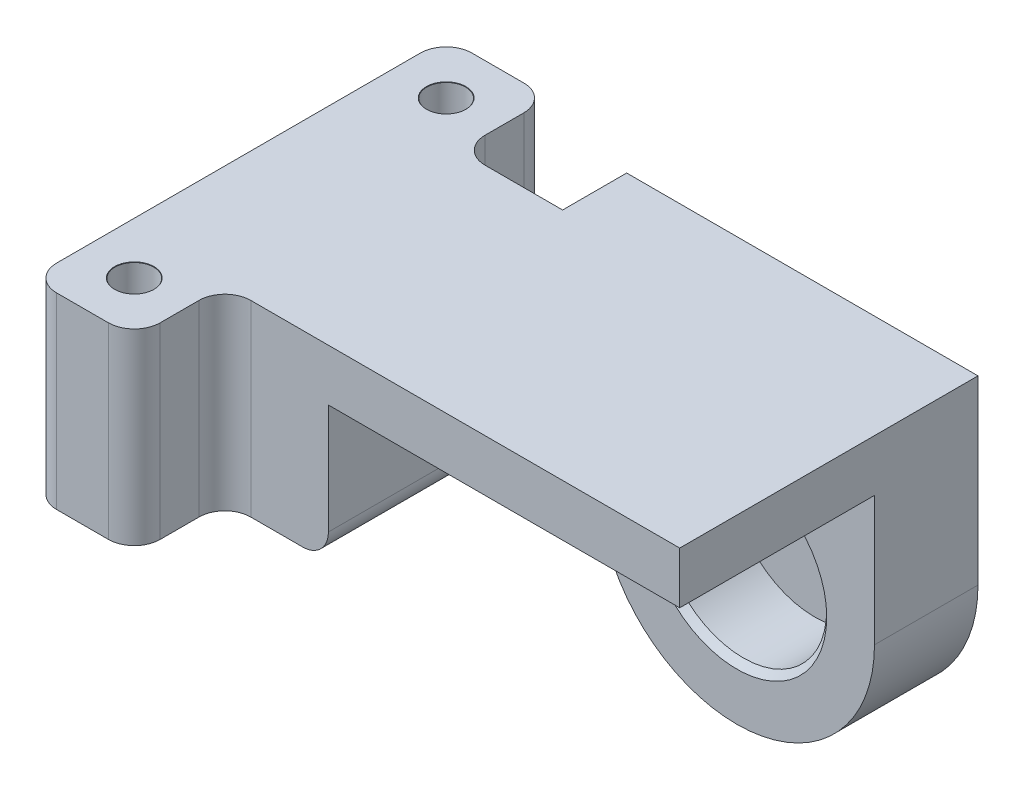
ISO-10303-21;
HEADER;
FILE_DESCRIPTION(('STEP AP214'),'2;1');
FILE_NAME('part.step','',(''),(''),'','','');
FILE_SCHEMA(('AUTOMOTIVE_DESIGN { 1 0 10303 214 1 1 1 1 }'));
ENDSEC;
DATA;
#1=APPLICATION_CONTEXT('core data for automotive mechanical design processes');
#2=APPLICATION_PROTOCOL_DEFINITION('international standard','automotive_design',2000,#1);
#3=PRODUCT_CONTEXT('',#1,'mechanical');
#4=PRODUCT('Part','Part','',(#3));
#5=PRODUCT_RELATED_PRODUCT_CATEGORY('part','',(#4));
#6=PRODUCT_DEFINITION_FORMATION('','',#4);
#7=PRODUCT_DEFINITION_CONTEXT('part definition',#1,'design');
#8=PRODUCT_DEFINITION('design','',#6,#7);
#9=PRODUCT_DEFINITION_SHAPE('','',#8);
#10=(LENGTH_UNIT() NAMED_UNIT(*) SI_UNIT(.MILLI.,.METRE.));
#11=(NAMED_UNIT(*) PLANE_ANGLE_UNIT() SI_UNIT($,.RADIAN.));
#12=(NAMED_UNIT(*) SI_UNIT($,.STERADIAN.) SOLID_ANGLE_UNIT());
#13=UNCERTAINTY_MEASURE_WITH_UNIT(LENGTH_MEASURE(1.E-05),#10,'distance_accuracy_value','');
#14=(GEOMETRIC_REPRESENTATION_CONTEXT(3) GLOBAL_UNCERTAINTY_ASSIGNED_CONTEXT((#13)) GLOBAL_UNIT_ASSIGNED_CONTEXT((#10,
#11,#12)) REPRESENTATION_CONTEXT('',''));
#15=CARTESIAN_POINT('',(0.,0.,0.));
#16=DIRECTION('',(0.,0.,1.));
#17=DIRECTION('',(1.,0.,0.));
#18=AXIS2_PLACEMENT_3D('',#15,#16,#17);
#19=CARTESIAN_POINT('',(43.15,4.,-9.05));
#20=DIRECTION('',(0.,0.,1.));
#21=DIRECTION('',(1.,0.,0.));
#22=AXIS2_PLACEMENT_3D('',#19,#20,#21);
#23=PLANE('',#22);
#24=DIRECTION('',(0.,1.,0.));
#25=VECTOR('',#24,1.);
#26=CARTESIAN_POINT('',(16.,4.,-9.05));
#27=LINE('',#26,#25);
#28=CARTESIAN_POINT('',(16.,0.,-9.05));
#29=VERTEX_POINT('',#28);
#30=CARTESIAN_POINT('',(16.,4.,-9.05));
#31=VERTEX_POINT('',#30);
#32=EDGE_CURVE('E238',#29,#31,#27,.T.);
#33=ORIENTED_EDGE('',*,*,#32,.F.);
#34=DIRECTION('',(0.,1.,0.));
#35=VECTOR('',#34,1.);
#36=CARTESIAN_POINT('',(16.,-10.5,-9.05));
#37=LINE('',#36,#35);
#38=CARTESIAN_POINT('',(16.,-8.5,-9.05));
#39=VERTEX_POINT('',#38);
#40=EDGE_CURVE('E327',#39,#29,#37,.T.);
#41=ORIENTED_EDGE('',*,*,#40,.F.);
#42=CARTESIAN_POINT('',(14.,-8.5,-9.05));
#43=DIRECTION('',(0.,0.,1.));
#44=DIRECTION('',(1.,0.,0.));
#45=AXIS2_PLACEMENT_3D('',#42,#43,#44);
#46=CIRCLE('',#45,2.);
#47=CARTESIAN_POINT('',(14.,-10.5,-9.05));
#48=VERTEX_POINT('',#47);
#49=EDGE_CURVE('E450',#39,#48,#46,.F.);
#50=ORIENTED_EDGE('',*,*,#49,.T.);
#51=DIRECTION('',(1.,0.,0.));
#52=VECTOR('',#51,1.);
#53=CARTESIAN_POINT('',(10.,-10.5,-9.05));
#54=LINE('',#53,#52);
#55=CARTESIAN_POINT('',(10.,-10.5,-9.05));
#56=VERTEX_POINT('',#55);
#57=EDGE_CURVE('E298',#56,#48,#54,.T.);
#58=ORIENTED_EDGE('',*,*,#57,.F.);
#59=DIRECTION('',(0.,-1.,0.));
#60=VECTOR('',#59,1.);
#61=CARTESIAN_POINT('',(10.,4.,-9.05));
#62=LINE('',#61,#60);
#63=CARTESIAN_POINT('',(10.,4.,-9.05));
#64=VERTEX_POINT('',#63);
#65=EDGE_CURVE('E414',#56,#64,#62,.F.);
#66=ORIENTED_EDGE('',*,*,#65,.T.);
#67=DIRECTION('',(-1.,0.,0.));
#68=VECTOR('',#67,1.);
#69=CARTESIAN_POINT('',(43.15,4.,-9.05));
#70=LINE('',#69,#68);
#71=EDGE_CURVE('E370',#31,#64,#70,.T.);
#72=ORIENTED_EDGE('',*,*,#71,.F.);
#73=EDGE_LOOP('',(#33,#41,#50,#58,#66,#72));
#74=FACE_BOUND('',#73,.T.);
#75=ADVANCED_FACE('F45',(#74),#23,.F.);
#76=CARTESIAN_POINT('',(0.,0.,0.));
#77=DIRECTION('',(0.,1.,0.));
#78=DIRECTION('',(0.,0.,1.));
#79=AXIS2_PLACEMENT_3D('',#76,#77,#78);
#80=PLANE('',#79);
#81=DIRECTION('',(-1.,0.,0.));
#82=VECTOR('',#81,1.);
#83=CARTESIAN_POINT('',(43.15,0.,-14.));
#84=LINE('',#83,#82);
#85=CARTESIAN_POINT('',(21.87,0.,-14.));
#86=VERTEX_POINT('',#85);
#87=CARTESIAN_POINT('',(16.,0.,-14.));
#88=VERTEX_POINT('',#87);
#89=EDGE_CURVE('E244',#86,#88,#84,.T.);
#90=ORIENTED_EDGE('',*,*,#89,.F.);
#91=DIRECTION('',(0.,0.,-1.));
#92=VECTOR('',#91,1.);
#93=CARTESIAN_POINT('',(21.87,0.,-6.));
#94=LINE('',#93,#92);
#95=CARTESIAN_POINT('',(21.87,0.,-6.));
#96=VERTEX_POINT('',#95);
#97=EDGE_CURVE('E235',#96,#86,#94,.T.);
#98=ORIENTED_EDGE('',*,*,#97,.F.);
#99=DIRECTION('',(1.,0.,0.));
#100=VECTOR('',#99,1.);
#101=CARTESIAN_POINT('',(43.15,0.,-6.));
#102=LINE('',#101,#100);
#103=CARTESIAN_POINT('',(43.15,0.,-6.));
#104=VERTEX_POINT('',#103);
#105=EDGE_CURVE('E206',#96,#104,#102,.T.);
#106=ORIENTED_EDGE('',*,*,#105,.T.);
#107=DIRECTION('',(0.,0.,-1.));
#108=VECTOR('',#107,1.);
#109=CARTESIAN_POINT('',(43.15,0.,9.05));
#110=LINE('',#109,#108);
#111=CARTESIAN_POINT('',(43.15,0.,9.05));
#112=VERTEX_POINT('',#111);
#113=EDGE_CURVE('E221',#112,#104,#110,.T.);
#114=ORIENTED_EDGE('',*,*,#113,.F.);
#115=DIRECTION('',(1.,0.,0.));
#116=VECTOR('',#115,1.);
#117=CARTESIAN_POINT('',(8.,0.,9.05));
#118=LINE('',#117,#116);
#119=CARTESIAN_POINT('',(16.,0.,9.05));
#120=VERTEX_POINT('',#119);
#121=EDGE_CURVE('E347',#120,#112,#118,.T.);
#122=ORIENTED_EDGE('',*,*,#121,.F.);
#123=DIRECTION('',(0.,0.,1.));
#124=VECTOR('',#123,1.);
#125=CARTESIAN_POINT('',(16.,0.,9.05));
#126=LINE('',#125,#124);
#127=EDGE_CURVE('E269',#29,#120,#126,.T.);
#128=ORIENTED_EDGE('',*,*,#127,.F.);
#129=DIRECTION('',(0.,0.,1.));
#130=VECTOR('',#129,1.);
#131=CARTESIAN_POINT('',(16.,0.,-14.));
#132=LINE('',#131,#130);
#133=EDGE_CURVE('E258',#88,#29,#132,.T.);
#134=ORIENTED_EDGE('',*,*,#133,.F.);
#135=EDGE_LOOP('',(#90,#98,#106,#114,#122,#128,#134));
#136=FACE_BOUND('',#135,.T.);
#137=ADVANCED_FACE('F469',(#136),#80,.F.);
#138=CARTESIAN_POINT('',(8.,4.,-16.05));
#139=DIRECTION('',(0.,0.,1.));
#140=DIRECTION('',(1.,0.,0.));
#141=AXIS2_PLACEMENT_3D('',#138,#139,#140);
#142=PLANE('',#141);
#143=DIRECTION('',(0.,-1.,0.));
#144=VECTOR('',#143,1.);
#145=CARTESIAN_POINT('',(6.,4.,-16.05));
#146=LINE('',#145,#144);
#147=CARTESIAN_POINT('',(6.,4.,-16.05));
#148=VERTEX_POINT('',#147);
#149=CARTESIAN_POINT('',(6.,-10.5,-16.05));
#150=VERTEX_POINT('',#149);
#151=EDGE_CURVE('E390',#148,#150,#146,.T.);
#152=ORIENTED_EDGE('',*,*,#151,.T.);
#153=DIRECTION('',(1.,0.,0.));
#154=VECTOR('',#153,1.);
#155=CARTESIAN_POINT('',(2.,-10.5,-16.05));
#156=LINE('',#155,#154);
#157=CARTESIAN_POINT('',(2.,-10.5,-16.05));
#158=VERTEX_POINT('',#157);
#159=EDGE_CURVE('E282',#158,#150,#156,.T.);
#160=ORIENTED_EDGE('',*,*,#159,.F.);
#161=DIRECTION('',(0.,-1.,0.));
#162=VECTOR('',#161,1.);
#163=CARTESIAN_POINT('',(2.,4.,-16.05));
#164=LINE('',#163,#162);
#165=CARTESIAN_POINT('',(2.,4.,-16.05));
#166=VERTEX_POINT('',#165);
#167=EDGE_CURVE('E393',#158,#166,#164,.F.);
#168=ORIENTED_EDGE('',*,*,#167,.T.);
#169=DIRECTION('',(-1.,0.,0.));
#170=VECTOR('',#169,1.);
#171=CARTESIAN_POINT('',(8.,4.,-16.05));
#172=LINE('',#171,#170);
#173=EDGE_CURVE('E348',#148,#166,#172,.T.);
#174=ORIENTED_EDGE('',*,*,#173,.F.);
#175=EDGE_LOOP('',(#152,#160,#168,#174));
#176=FACE_BOUND('',#175,.T.);
#177=ADVANCED_FACE('F475',(#176),#142,.F.);
#178=CARTESIAN_POINT('',(0.,4.,-16.05));
#179=DIRECTION('',(1.,0.,0.));
#180=DIRECTION('',(0.,0.,-1.));
#181=AXIS2_PLACEMENT_3D('',#178,#179,#180);
#182=PLANE('',#181);
#183=DIRECTION('',(0.,0.,1.));
#184=VECTOR('',#183,1.);
#185=CARTESIAN_POINT('',(0.,4.,-16.05));
#186=LINE('',#185,#184);
#187=CARTESIAN_POINT('',(0.,4.,-14.05));
#188=VERTEX_POINT('',#187);
#189=CARTESIAN_POINT('',(0.,4.,14.05));
#190=VERTEX_POINT('',#189);
#191=EDGE_CURVE('E352',#188,#190,#186,.T.);
#192=ORIENTED_EDGE('',*,*,#191,.F.);
#193=DIRECTION('',(0.,-1.,0.));
#194=VECTOR('',#193,1.);
#195=CARTESIAN_POINT('',(0.,4.,-14.05));
#196=LINE('',#195,#194);
#197=CARTESIAN_POINT('',(0.,-10.5,-14.05));
#198=VERTEX_POINT('',#197);
#199=EDGE_CURVE('E387',#188,#198,#196,.T.);
#200=ORIENTED_EDGE('',*,*,#199,.T.);
#201=DIRECTION('',(0.,0.,-1.));
#202=VECTOR('',#201,1.);
#203=CARTESIAN_POINT('',(0.,-10.5,14.05));
#204=LINE('',#203,#202);
#205=CARTESIAN_POINT('',(0.,-10.5,14.05));
#206=VERTEX_POINT('',#205);
#207=EDGE_CURVE('E274',#206,#198,#204,.T.);
#208=ORIENTED_EDGE('',*,*,#207,.F.);
#209=DIRECTION('',(0.,-1.,0.));
#210=VECTOR('',#209,1.);
#211=CARTESIAN_POINT('',(0.,4.,14.05));
#212=LINE('',#211,#210);
#213=EDGE_CURVE('E384',#206,#190,#212,.F.);
#214=ORIENTED_EDGE('',*,*,#213,.T.);
#215=EDGE_LOOP('',(#192,#200,#208,#214));
#216=FACE_BOUND('',#215,.T.);
#217=ADVANCED_FACE('F495',(#216),#182,.F.);
#218=CARTESIAN_POINT('',(0.,4.,16.05));
#219=DIRECTION('',(0.,0.,-1.));
#220=DIRECTION('',(-1.,0.,0.));
#221=AXIS2_PLACEMENT_3D('',#218,#219,#220);
#222=PLANE('',#221);
#223=DIRECTION('',(1.,0.,0.));
#224=VECTOR('',#223,1.);
#225=CARTESIAN_POINT('',(0.,4.,16.05));
#226=LINE('',#225,#224);
#227=CARTESIAN_POINT('',(2.,4.,16.05));
#228=VERTEX_POINT('',#227);
#229=CARTESIAN_POINT('',(6.,4.,16.05));
#230=VERTEX_POINT('',#229);
#231=EDGE_CURVE('E356',#228,#230,#226,.T.);
#232=ORIENTED_EDGE('',*,*,#231,.F.);
#233=DIRECTION('',(0.,-1.,0.));
#234=VECTOR('',#233,1.);
#235=CARTESIAN_POINT('',(2.,4.,16.05));
#236=LINE('',#235,#234);
#237=CARTESIAN_POINT('',(2.,-10.5,16.05));
#238=VERTEX_POINT('',#237);
#239=EDGE_CURVE('E421',#228,#238,#236,.T.);
#240=ORIENTED_EDGE('',*,*,#239,.T.);
#241=DIRECTION('',(-1.,0.,0.));
#242=VECTOR('',#241,1.);
#243=CARTESIAN_POINT('',(6.,-10.5,16.05));
#244=LINE('',#243,#242);
#245=CARTESIAN_POINT('',(6.,-10.5,16.05));
#246=VERTEX_POINT('',#245);
#247=EDGE_CURVE('E317',#246,#238,#244,.T.);
#248=ORIENTED_EDGE('',*,*,#247,.F.);
#249=DIRECTION('',(0.,-1.,0.));
#250=VECTOR('',#249,1.);
#251=CARTESIAN_POINT('',(6.,4.,16.05));
#252=LINE('',#251,#250);
#253=EDGE_CURVE('E418',#246,#230,#252,.F.);
#254=ORIENTED_EDGE('',*,*,#253,.T.);
#255=EDGE_LOOP('',(#232,#240,#248,#254));
#256=FACE_BOUND('',#255,.T.);
#257=ADVANCED_FACE('F491',(#256),#222,.F.);
#258=CARTESIAN_POINT('',(8.,4.,16.05));
#259=DIRECTION('',(-1.,0.,0.));
#260=DIRECTION('',(0.,0.,1.));
#261=AXIS2_PLACEMENT_3D('',#258,#259,#260);
#262=PLANE('',#261);
#263=DIRECTION('',(0.,0.,-1.));
#264=VECTOR('',#263,1.);
#265=CARTESIAN_POINT('',(8.,4.,16.05));
#266=LINE('',#265,#264);
#267=CARTESIAN_POINT('',(8.,4.,14.05));
#268=VERTEX_POINT('',#267);
#269=CARTESIAN_POINT('',(8.,4.,11.05));
#270=VERTEX_POINT('',#269);
#271=EDGE_CURVE('E360',#268,#270,#266,.T.);
#272=ORIENTED_EDGE('',*,*,#271,.F.);
#273=DIRECTION('',(0.,-1.,0.));
#274=VECTOR('',#273,1.);
#275=CARTESIAN_POINT('',(8.,4.,14.05));
#276=LINE('',#275,#274);
#277=CARTESIAN_POINT('',(8.,-10.5,14.05));
#278=VERTEX_POINT('',#277);
#279=EDGE_CURVE('E427',#268,#278,#276,.T.);
#280=ORIENTED_EDGE('',*,*,#279,.T.);
#281=DIRECTION('',(0.,0.,1.));
#282=VECTOR('',#281,1.);
#283=CARTESIAN_POINT('',(8.,-10.5,11.05));
#284=LINE('',#283,#282);
#285=CARTESIAN_POINT('',(8.,-10.5,11.05));
#286=VERTEX_POINT('',#285);
#287=EDGE_CURVE('E309',#286,#278,#284,.T.);
#288=ORIENTED_EDGE('',*,*,#287,.F.);
#289=DIRECTION('',(0.,-1.,0.));
#290=VECTOR('',#289,1.);
#291=CARTESIAN_POINT('',(8.,4.,11.05));
#292=LINE('',#291,#290);
#293=EDGE_CURVE('E424',#286,#270,#292,.F.);
#294=ORIENTED_EDGE('',*,*,#293,.T.);
#295=EDGE_LOOP('',(#272,#280,#288,#294));
#296=FACE_BOUND('',#295,.T.);
#297=ADVANCED_FACE('F487',(#296),#262,.F.);
#298=CARTESIAN_POINT('',(8.,4.,9.05));
#299=DIRECTION('',(0.,0.,-1.));
#300=DIRECTION('',(-1.,0.,0.));
#301=AXIS2_PLACEMENT_3D('',#298,#299,#300);
#302=PLANE('',#301);
#303=DIRECTION('',(-1.,0.,0.));
#304=VECTOR('',#303,1.);
#305=CARTESIAN_POINT('',(16.,-10.5,9.05));
#306=LINE('',#305,#304);
#307=CARTESIAN_POINT('',(14.,-10.5,9.05));
#308=VERTEX_POINT('',#307);
#309=CARTESIAN_POINT('',(10.,-10.5,9.05));
#310=VERTEX_POINT('',#309);
#311=EDGE_CURVE('E302',#308,#310,#306,.T.);
#312=ORIENTED_EDGE('',*,*,#311,.F.);
#313=CARTESIAN_POINT('',(14.,-8.5,9.05));
#314=DIRECTION('',(0.,0.,-1.));
#315=DIRECTION('',(-1.,0.,0.));
#316=AXIS2_PLACEMENT_3D('',#313,#314,#315);
#317=CIRCLE('',#316,2.);
#318=CARTESIAN_POINT('',(16.,-8.5,9.05));
#319=VERTEX_POINT('',#318);
#320=EDGE_CURVE('E444',#308,#319,#317,.F.);
#321=ORIENTED_EDGE('',*,*,#320,.T.);
#322=DIRECTION('',(0.,1.,0.));
#323=VECTOR('',#322,1.);
#324=CARTESIAN_POINT('',(16.,-10.5,9.05));
#325=LINE('',#324,#323);
#326=EDGE_CURVE('E321',#319,#120,#325,.T.);
#327=ORIENTED_EDGE('',*,*,#326,.T.);
#328=ORIENTED_EDGE('',*,*,#121,.T.);
#329=DIRECTION('',(0.,-1.,0.));
#330=VECTOR('',#329,1.);
#331=CARTESIAN_POINT('',(43.15,4.,9.05));
#332=LINE('',#331,#330);
#333=CARTESIAN_POINT('',(43.15,4.,9.05));
#334=VERTEX_POINT('',#333);
#335=EDGE_CURVE('E377',#334,#112,#332,.T.);
#336=ORIENTED_EDGE('',*,*,#335,.F.);
#337=DIRECTION('',(1.,0.,0.));
#338=VECTOR('',#337,1.);
#339=CARTESIAN_POINT('',(8.,4.,9.05));
#340=LINE('',#339,#338);
#341=CARTESIAN_POINT('',(10.,4.,9.05));
#342=VERTEX_POINT('',#341);
#343=EDGE_CURVE('E364',#342,#334,#340,.T.);
#344=ORIENTED_EDGE('',*,*,#343,.F.);
#345=DIRECTION('',(0.,-1.,0.));
#346=VECTOR('',#345,1.);
#347=CARTESIAN_POINT('',(10.,0.,9.05));
#348=LINE('',#347,#346);
#349=EDGE_CURVE('E430',#342,#310,#348,.T.);
#350=ORIENTED_EDGE('',*,*,#349,.T.);
#351=EDGE_LOOP('',(#312,#321,#327,#328,#336,#344,#350));
#352=FACE_BOUND('',#351,.T.);
#353=ADVANCED_FACE('F484',(#352),#302,.F.);
#354=CARTESIAN_POINT('',(43.15,4.,9.05));
#355=DIRECTION('',(-1.,0.,0.));
#356=DIRECTION('',(0.,0.,1.));
#357=AXIS2_PLACEMENT_3D('',#354,#355,#356);
#358=PLANE('',#357);
#359=ORIENTED_EDGE('',*,*,#113,.T.);
#360=DIRECTION('',(0.,-1.,0.));
#361=VECTOR('',#360,1.);
#362=CARTESIAN_POINT('',(43.15,0.,-6.));
#363=LINE('',#362,#361);
#364=CARTESIAN_POINT('',(43.15,-10.,-6.));
#365=VERTEX_POINT('',#364);
#366=EDGE_CURVE('E212',#104,#365,#363,.T.);
#367=ORIENTED_EDGE('',*,*,#366,.T.);
#368=DIRECTION('',(0.,0.,-1.));
#369=VECTOR('',#368,1.);
#370=CARTESIAN_POINT('',(43.15,-10.,-6.));
#371=LINE('',#370,#369);
#372=CARTESIAN_POINT('',(43.15,-10.,-14.));
#373=VERTEX_POINT('',#372);
#374=EDGE_CURVE('E196',#365,#373,#371,.T.);
#375=ORIENTED_EDGE('',*,*,#374,.T.);
#376=DIRECTION('',(0.,-1.,0.));
#377=VECTOR('',#376,1.);
#378=CARTESIAN_POINT('',(43.15,4.,-14.));
#379=LINE('',#378,#377);
#380=CARTESIAN_POINT('',(43.15,4.,-14.));
#381=VERTEX_POINT('',#380);
#382=EDGE_CURVE('E241',#381,#373,#379,.T.);
#383=ORIENTED_EDGE('',*,*,#382,.F.);
#384=DIRECTION('',(0.,0.,-1.));
#385=VECTOR('',#384,1.);
#386=CARTESIAN_POINT('',(43.15,4.,9.05));
#387=LINE('',#386,#385);
#388=EDGE_CURVE('E367',#334,#381,#387,.T.);
#389=ORIENTED_EDGE('',*,*,#388,.F.);
#390=ORIENTED_EDGE('',*,*,#335,.T.);
#391=EDGE_LOOP('',(#359,#367,#375,#383,#389,#390));
#392=FACE_BOUND('',#391,.T.);
#393=ADVANCED_FACE('F218',(#392),#358,.F.);
#394=CARTESIAN_POINT('',(8.,4.,-9.05));
#395=DIRECTION('',(-1.,0.,0.));
#396=DIRECTION('',(0.,0.,1.));
#397=AXIS2_PLACEMENT_3D('',#394,#395,#396);
#398=PLANE('',#397);
#399=DIRECTION('',(0.,0.,-1.));
#400=VECTOR('',#399,1.);
#401=CARTESIAN_POINT('',(8.,4.,-9.05));
#402=LINE('',#401,#400);
#403=CARTESIAN_POINT('',(8.,4.,-11.05));
#404=VERTEX_POINT('',#403);
#405=CARTESIAN_POINT('',(8.,4.,-14.05));
#406=VERTEX_POINT('',#405);
#407=EDGE_CURVE('E373',#404,#406,#402,.T.);
#408=ORIENTED_EDGE('',*,*,#407,.F.);
#409=DIRECTION('',(0.,-1.,0.));
#410=VECTOR('',#409,1.);
#411=CARTESIAN_POINT('',(8.,0.,-11.05));
#412=LINE('',#411,#410);
#413=CARTESIAN_POINT('',(8.,-10.5,-11.05));
#414=VERTEX_POINT('',#413);
#415=EDGE_CURVE('E411',#404,#414,#412,.T.);
#416=ORIENTED_EDGE('',*,*,#415,.T.);
#417=DIRECTION('',(0.,0.,1.));
#418=VECTOR('',#417,1.);
#419=CARTESIAN_POINT('',(8.,-10.5,-14.05));
#420=LINE('',#419,#418);
#421=CARTESIAN_POINT('',(8.,-10.5,-14.05));
#422=VERTEX_POINT('',#421);
#423=EDGE_CURVE('E290',#422,#414,#420,.T.);
#424=ORIENTED_EDGE('',*,*,#423,.F.);
#425=DIRECTION('',(0.,-1.,0.));
#426=VECTOR('',#425,1.);
#427=CARTESIAN_POINT('',(8.,4.,-14.05));
#428=LINE('',#427,#426);
#429=EDGE_CURVE('E408',#422,#406,#428,.F.);
#430=ORIENTED_EDGE('',*,*,#429,.T.);
#431=EDGE_LOOP('',(#408,#416,#424,#430));
#432=FACE_BOUND('',#431,.T.);
#433=ADVANCED_FACE('F481',(#432),#398,.F.);
#434=CARTESIAN_POINT('',(0.,4.,0.));
#435=DIRECTION('',(0.,1.,0.));
#436=DIRECTION('',(0.,0.,1.));
#437=AXIS2_PLACEMENT_3D('',#434,#435,#436);
#438=PLANE('',#437);
#439=CARTESIAN_POINT('',(4.,4.,-12.05));
#440=DIRECTION('',(0.,1.,0.));
#441=DIRECTION('',(0.,0.,1.));
#442=AXIS2_PLACEMENT_3D('',#439,#440,#441);
#443=CIRCLE('',#442,1.525);
#444=CARTESIAN_POINT('',(4.,4.,-10.525));
#445=VERTEX_POINT('',#444);
#446=EDGE_CURVE('E331',#445,#445,#443,.T.);
#447=ORIENTED_EDGE('',*,*,#446,.F.);
#448=EDGE_LOOP('',(#447));
#449=FACE_BOUND('',#448,.T.);
#450=CARTESIAN_POINT('',(4.,4.,12.05));
#451=DIRECTION('',(0.,1.,0.));
#452=DIRECTION('',(0.,0.,1.));
#453=AXIS2_PLACEMENT_3D('',#450,#451,#452);
#454=CIRCLE('',#453,1.525);
#455=CARTESIAN_POINT('',(4.,4.,13.575));
#456=VERTEX_POINT('',#455);
#457=EDGE_CURVE('E339',#456,#456,#454,.T.);
#458=ORIENTED_EDGE('',*,*,#457,.F.);
#459=EDGE_LOOP('',(#458));
#460=FACE_BOUND('',#459,.T.);
#461=ORIENTED_EDGE('',*,*,#173,.T.);
#462=CARTESIAN_POINT('',(2.,4.,-14.05));
#463=DIRECTION('',(0.,1.,0.));
#464=DIRECTION('',(0.,0.,1.));
#465=AXIS2_PLACEMENT_3D('',#462,#463,#464);
#466=CIRCLE('',#465,2.);
#467=EDGE_CURVE('E405',#166,#188,#466,.T.);
#468=ORIENTED_EDGE('',*,*,#467,.T.);
#469=ORIENTED_EDGE('',*,*,#191,.T.);
#470=CARTESIAN_POINT('',(2.,4.,14.05));
#471=DIRECTION('',(0.,1.,0.));
#472=DIRECTION('',(0.,0.,1.));
#473=AXIS2_PLACEMENT_3D('',#470,#471,#472);
#474=CIRCLE('',#473,2.);
#475=EDGE_CURVE('E399',#190,#228,#474,.T.);
#476=ORIENTED_EDGE('',*,*,#475,.T.);
#477=ORIENTED_EDGE('',*,*,#231,.T.);
#478=CARTESIAN_POINT('',(6.,4.,14.05));
#479=DIRECTION('',(0.,1.,0.));
#480=DIRECTION('',(0.,0.,1.));
#481=AXIS2_PLACEMENT_3D('',#478,#479,#480);
#482=CIRCLE('',#481,2.);
#483=EDGE_CURVE('E396',#230,#268,#482,.T.);
#484=ORIENTED_EDGE('',*,*,#483,.T.);
#485=ORIENTED_EDGE('',*,*,#271,.T.);
#486=CARTESIAN_POINT('',(10.,4.,11.05));
#487=DIRECTION('',(0.,1.,0.));
#488=DIRECTION('',(0.,0.,1.));
#489=AXIS2_PLACEMENT_3D('',#486,#487,#488);
#490=CIRCLE('',#489,2.);
#491=EDGE_CURVE('E437',#270,#342,#490,.F.);
#492=ORIENTED_EDGE('',*,*,#491,.T.);
#493=ORIENTED_EDGE('',*,*,#343,.T.);
#494=ORIENTED_EDGE('',*,*,#388,.T.);
#495=DIRECTION('',(1.,0.,0.));
#496=VECTOR('',#495,1.);
#497=CARTESIAN_POINT('',(43.15,4.,-14.));
#498=LINE('',#497,#496);
#499=CARTESIAN_POINT('',(16.,4.,-14.));
#500=VERTEX_POINT('',#499);
#501=EDGE_CURVE('E250',#500,#381,#498,.T.);
#502=ORIENTED_EDGE('',*,*,#501,.F.);
#503=DIRECTION('',(0.,0.,1.));
#504=VECTOR('',#503,1.);
#505=CARTESIAN_POINT('',(16.,4.,-14.));
#506=LINE('',#505,#504);
#507=EDGE_CURVE('E70',#500,#31,#506,.T.);
#508=ORIENTED_EDGE('',*,*,#507,.T.);
#509=ORIENTED_EDGE('',*,*,#71,.T.);
#510=CARTESIAN_POINT('',(10.,4.,-11.05));
#511=DIRECTION('',(0.,1.,0.));
#512=DIRECTION('',(0.,0.,1.));
#513=AXIS2_PLACEMENT_3D('',#510,#511,#512);
#514=CIRCLE('',#513,2.);
#515=EDGE_CURVE('E434',#64,#404,#514,.F.);
#516=ORIENTED_EDGE('',*,*,#515,.T.);
#517=ORIENTED_EDGE('',*,*,#407,.T.);
#518=CARTESIAN_POINT('',(6.,4.,-14.05));
#519=DIRECTION('',(0.,1.,0.));
#520=DIRECTION('',(0.,0.,1.));
#521=AXIS2_PLACEMENT_3D('',#518,#519,#520);
#522=CIRCLE('',#521,2.);
#523=EDGE_CURVE('E402',#406,#148,#522,.T.);
#524=ORIENTED_EDGE('',*,*,#523,.T.);
#525=EDGE_LOOP('',(#461,#468,#469,#476,#477,#484,#485,#492,#493,#494,#502,#508,#509,#516,#517,#524));
#526=FACE_BOUND('',#525,.T.);
#527=ADVANCED_FACE('F507',(#449,#460,#526),#438,.T.);
#528=CARTESIAN_POINT('',(2.,4.,-14.05));
#529=DIRECTION('',(0.,-1.,0.));
#530=DIRECTION('',(0.,0.,-1.));
#531=AXIS2_PLACEMENT_3D('',#528,#529,#530);
#532=CYLINDRICAL_SURFACE('',#531,2.);
#533=ORIENTED_EDGE('',*,*,#467,.F.);
#534=ORIENTED_EDGE('',*,*,#167,.F.);
#535=CARTESIAN_POINT('',(2.,-10.5,-14.05));
#536=DIRECTION('',(0.,-1.,0.));
#537=DIRECTION('',(0.,0.,-1.));
#538=AXIS2_PLACEMENT_3D('',#535,#536,#537);
#539=CIRCLE('',#538,2.);
#540=EDGE_CURVE('E278',#198,#158,#539,.T.);
#541=ORIENTED_EDGE('',*,*,#540,.F.);
#542=ORIENTED_EDGE('',*,*,#199,.F.);
#543=EDGE_LOOP('',(#533,#534,#541,#542));
#544=FACE_BOUND('',#543,.T.);
#545=ADVANCED_FACE('F503',(#544),#532,.T.);
#546=CARTESIAN_POINT('',(10.,4.,-11.05));
#547=DIRECTION('',(0.,1.,0.));
#548=DIRECTION('',(0.,0.,1.));
#549=AXIS2_PLACEMENT_3D('',#546,#547,#548);
#550=CYLINDRICAL_SURFACE('',#549,2.);
#551=ORIENTED_EDGE('',*,*,#515,.F.);
#552=ORIENTED_EDGE('',*,*,#65,.F.);
#553=CARTESIAN_POINT('',(10.,-10.5,-11.05));
#554=DIRECTION('',(0.,1.,0.));
#555=DIRECTION('',(0.,0.,-1.));
#556=AXIS2_PLACEMENT_3D('',#553,#554,#555);
#557=CIRCLE('',#556,2.);
#558=EDGE_CURVE('E294',#414,#56,#557,.T.);
#559=ORIENTED_EDGE('',*,*,#558,.F.);
#560=ORIENTED_EDGE('',*,*,#415,.F.);
#561=EDGE_LOOP('',(#551,#552,#559,#560));
#562=FACE_BOUND('',#561,.T.);
#563=ADVANCED_FACE('F506',(#562),#550,.F.);
#564=CARTESIAN_POINT('',(6.,4.,-14.05));
#565=DIRECTION('',(0.,-1.,0.));
#566=DIRECTION('',(0.,0.,-1.));
#567=AXIS2_PLACEMENT_3D('',#564,#565,#566);
#568=CYLINDRICAL_SURFACE('',#567,2.);
#569=ORIENTED_EDGE('',*,*,#523,.F.);
#570=ORIENTED_EDGE('',*,*,#429,.F.);
#571=CARTESIAN_POINT('',(6.,-10.5,-14.05));
#572=DIRECTION('',(0.,-1.,0.));
#573=DIRECTION('',(0.,0.,-1.));
#574=AXIS2_PLACEMENT_3D('',#571,#572,#573);
#575=CIRCLE('',#574,2.);
#576=EDGE_CURVE('E286',#150,#422,#575,.T.);
#577=ORIENTED_EDGE('',*,*,#576,.F.);
#578=ORIENTED_EDGE('',*,*,#151,.F.);
#579=EDGE_LOOP('',(#569,#570,#577,#578));
#580=FACE_BOUND('',#579,.T.);
#581=ADVANCED_FACE('F511',(#580),#568,.T.);
#582=CARTESIAN_POINT('',(2.,4.,14.05));
#583=DIRECTION('',(0.,-1.,0.));
#584=DIRECTION('',(0.,0.,-1.));
#585=AXIS2_PLACEMENT_3D('',#582,#583,#584);
#586=CYLINDRICAL_SURFACE('',#585,2.);
#587=ORIENTED_EDGE('',*,*,#475,.F.);
#588=ORIENTED_EDGE('',*,*,#213,.F.);
#589=CARTESIAN_POINT('',(2.,-10.5,14.05));
#590=DIRECTION('',(0.,-1.,0.));
#591=DIRECTION('',(0.,0.,-1.));
#592=AXIS2_PLACEMENT_3D('',#589,#590,#591);
#593=CIRCLE('',#592,2.);
#594=EDGE_CURVE('E270',#238,#206,#593,.T.);
#595=ORIENTED_EDGE('',*,*,#594,.F.);
#596=ORIENTED_EDGE('',*,*,#239,.F.);
#597=EDGE_LOOP('',(#587,#588,#595,#596));
#598=FACE_BOUND('',#597,.T.);
#599=ADVANCED_FACE('F515',(#598),#586,.T.);
#600=CARTESIAN_POINT('',(6.,4.,14.05));
#601=DIRECTION('',(0.,-1.,0.));
#602=DIRECTION('',(0.,0.,-1.));
#603=AXIS2_PLACEMENT_3D('',#600,#601,#602);
#604=CYLINDRICAL_SURFACE('',#603,2.);
#605=ORIENTED_EDGE('',*,*,#483,.F.);
#606=ORIENTED_EDGE('',*,*,#253,.F.);
#607=CARTESIAN_POINT('',(6.,-10.5,14.05));
#608=DIRECTION('',(0.,-1.,0.));
#609=DIRECTION('',(0.,0.,-1.));
#610=AXIS2_PLACEMENT_3D('',#607,#608,#609);
#611=CIRCLE('',#610,2.);
#612=EDGE_CURVE('E313',#278,#246,#611,.T.);
#613=ORIENTED_EDGE('',*,*,#612,.F.);
#614=ORIENTED_EDGE('',*,*,#279,.F.);
#615=EDGE_LOOP('',(#605,#606,#613,#614));
#616=FACE_BOUND('',#615,.T.);
#617=ADVANCED_FACE('F519',(#616),#604,.T.);
#618=CARTESIAN_POINT('',(10.,4.,11.05));
#619=DIRECTION('',(0.,1.,0.));
#620=DIRECTION('',(0.,0.,1.));
#621=AXIS2_PLACEMENT_3D('',#618,#619,#620);
#622=CYLINDRICAL_SURFACE('',#621,2.);
#623=ORIENTED_EDGE('',*,*,#491,.F.);
#624=ORIENTED_EDGE('',*,*,#293,.F.);
#625=CARTESIAN_POINT('',(10.,-10.5,11.05));
#626=DIRECTION('',(0.,1.,0.));
#627=DIRECTION('',(0.,0.,-1.));
#628=AXIS2_PLACEMENT_3D('',#625,#626,#627);
#629=CIRCLE('',#628,2.);
#630=EDGE_CURVE('E305',#310,#286,#629,.T.);
#631=ORIENTED_EDGE('',*,*,#630,.F.);
#632=ORIENTED_EDGE('',*,*,#349,.F.);
#633=EDGE_LOOP('',(#623,#624,#631,#632));
#634=FACE_BOUND('',#633,.T.);
#635=ADVANCED_FACE('F523',(#634),#622,.F.);
#636=CARTESIAN_POINT('',(4.,4.,12.05));
#637=DIRECTION('',(0.,1.,0.));
#638=DIRECTION('',(0.,0.,1.));
#639=AXIS2_PLACEMENT_3D('',#636,#637,#638);
#640=CYLINDRICAL_SURFACE('',#639,1.5);
#641=CARTESIAN_POINT('',(4.,3.975,12.05));
#642=DIRECTION('',(0.,1.,0.));
#643=DIRECTION('',(0.,0.,1.));
#644=AXIS2_PLACEMENT_3D('',#641,#642,#643);
#645=CIRCLE('',#644,1.5);
#646=CARTESIAN_POINT('',(4.,3.975,13.55));
#647=VERTEX_POINT('',#646);
#648=EDGE_CURVE('E343',#647,#647,#645,.T.);
#649=ORIENTED_EDGE('',*,*,#648,.T.);
#650=EDGE_LOOP('',(#649));
#651=FACE_BOUND('',#650,.T.);
#652=CARTESIAN_POINT('',(4.,-10.5,12.05));
#653=DIRECTION('',(0.,-1.,0.));
#654=DIRECTION('',(0.,0.,-1.));
#655=AXIS2_PLACEMENT_3D('',#652,#653,#654);
#656=CIRCLE('',#655,1.5);
#657=CARTESIAN_POINT('',(4.,-10.5,10.55));
#658=VERTEX_POINT('',#657);
#659=EDGE_CURVE('E265',#658,#658,#656,.T.);
#660=ORIENTED_EDGE('',*,*,#659,.T.);
#661=EDGE_LOOP('',(#660));
#662=FACE_BOUND('',#661,.T.);
#663=ADVANCED_FACE('F526',(#651,#662),#640,.F.);
#664=CARTESIAN_POINT('',(4.,4.,12.05));
#665=DIRECTION('',(0.,1.,0.));
#666=DIRECTION('',(0.,0.,1.));
#667=AXIS2_PLACEMENT_3D('',#664,#665,#666);
#668=CONICAL_SURFACE('',#667,1.525,0.785398163397466);
#669=ORIENTED_EDGE('',*,*,#648,.F.);
#670=EDGE_LOOP('',(#669));
#671=FACE_BOUND('',#670,.T.);
#672=ORIENTED_EDGE('',*,*,#457,.T.);
#673=EDGE_LOOP('',(#672));
#674=FACE_BOUND('',#673,.T.);
#675=ADVANCED_FACE('F614',(#671,#674),#668,.F.);
#676=CARTESIAN_POINT('',(4.,4.,-12.05));
#677=DIRECTION('',(0.,1.,0.));
#678=DIRECTION('',(0.,0.,1.));
#679=AXIS2_PLACEMENT_3D('',#676,#677,#678);
#680=CYLINDRICAL_SURFACE('',#679,1.5);
#681=CARTESIAN_POINT('',(4.,3.975,-12.05));
#682=DIRECTION('',(0.,1.,0.));
#683=DIRECTION('',(0.,0.,1.));
#684=AXIS2_PLACEMENT_3D('',#681,#682,#683);
#685=CIRCLE('',#684,1.5);
#686=CARTESIAN_POINT('',(4.,3.975,-10.55));
#687=VERTEX_POINT('',#686);
#688=EDGE_CURVE('E335',#687,#687,#685,.T.);
#689=ORIENTED_EDGE('',*,*,#688,.T.);
#690=EDGE_LOOP('',(#689));
#691=FACE_BOUND('',#690,.T.);
#692=CARTESIAN_POINT('',(4.,-10.5,-12.05));
#693=DIRECTION('',(0.,-1.,0.));
#694=DIRECTION('',(0.,0.,-1.));
#695=AXIS2_PLACEMENT_3D('',#692,#693,#694);
#696=CIRCLE('',#695,1.5);
#697=CARTESIAN_POINT('',(4.,-10.5,-13.55));
#698=VERTEX_POINT('',#697);
#699=EDGE_CURVE('E261',#698,#698,#696,.T.);
#700=ORIENTED_EDGE('',*,*,#699,.T.);
#701=EDGE_LOOP('',(#700));
#702=FACE_BOUND('',#701,.T.);
#703=ADVANCED_FACE('F610',(#691,#702),#680,.F.);
#704=CARTESIAN_POINT('',(4.,4.,-12.05));
#705=DIRECTION('',(0.,1.,0.));
#706=DIRECTION('',(0.,0.,1.));
#707=AXIS2_PLACEMENT_3D('',#704,#705,#706);
#708=CONICAL_SURFACE('',#707,1.525,0.785398163397466);
#709=ORIENTED_EDGE('',*,*,#688,.F.);
#710=EDGE_LOOP('',(#709));
#711=FACE_BOUND('',#710,.T.);
#712=ORIENTED_EDGE('',*,*,#446,.T.);
#713=EDGE_LOOP('',(#712));
#714=FACE_BOUND('',#713,.T.);
#715=ADVANCED_FACE('F605',(#711,#714),#708,.F.);
#716=CARTESIAN_POINT('',(2.,-10.5,14.05));
#717=DIRECTION('',(0.,-1.,0.));
#718=DIRECTION('',(0.,0.,-1.));
#719=AXIS2_PLACEMENT_3D('',#716,#717,#718);
#720=PLANE('',#719);
#721=ORIENTED_EDGE('',*,*,#659,.F.);
#722=EDGE_LOOP('',(#721));
#723=FACE_BOUND('',#722,.T.);
#724=ORIENTED_EDGE('',*,*,#57,.T.);
#725=DIRECTION('',(0.,0.,1.));
#726=VECTOR('',#725,1.);
#727=CARTESIAN_POINT('',(14.,-10.5,9.05));
#728=LINE('',#727,#726);
#729=EDGE_CURVE('E440',#48,#308,#728,.T.);
#730=ORIENTED_EDGE('',*,*,#729,.T.);
#731=ORIENTED_EDGE('',*,*,#311,.T.);
#732=ORIENTED_EDGE('',*,*,#630,.T.);
#733=ORIENTED_EDGE('',*,*,#287,.T.);
#734=ORIENTED_EDGE('',*,*,#612,.T.);
#735=ORIENTED_EDGE('',*,*,#247,.T.);
#736=ORIENTED_EDGE('',*,*,#594,.T.);
#737=ORIENTED_EDGE('',*,*,#207,.T.);
#738=ORIENTED_EDGE('',*,*,#540,.T.);
#739=ORIENTED_EDGE('',*,*,#159,.T.);
#740=ORIENTED_EDGE('',*,*,#576,.T.);
#741=ORIENTED_EDGE('',*,*,#423,.T.);
#742=ORIENTED_EDGE('',*,*,#558,.T.);
#743=EDGE_LOOP('',(#724,#730,#731,#732,#733,#734,#735,#736,#737,#738,#739,#740,#741,#742));
#744=FACE_BOUND('',#743,.T.);
#745=ORIENTED_EDGE('',*,*,#699,.F.);
#746=EDGE_LOOP('',(#745));
#747=FACE_BOUND('',#746,.T.);
#748=ADVANCED_FACE('F540',(#723,#744,#747),#720,.T.);
#749=CARTESIAN_POINT('',(16.,-10.5,9.05));
#750=DIRECTION('',(-1.,0.,0.));
#751=DIRECTION('',(0.,0.,1.));
#752=AXIS2_PLACEMENT_3D('',#749,#750,#751);
#753=PLANE('',#752);
#754=ORIENTED_EDGE('',*,*,#326,.F.);
#755=DIRECTION('',(0.,0.,1.));
#756=VECTOR('',#755,1.);
#757=CARTESIAN_POINT('',(16.,-8.5,-9.05));
#758=LINE('',#757,#756);
#759=EDGE_CURVE('E447',#319,#39,#758,.F.);
#760=ORIENTED_EDGE('',*,*,#759,.T.);
#761=ORIENTED_EDGE('',*,*,#40,.T.);
#762=ORIENTED_EDGE('',*,*,#127,.T.);
#763=EDGE_LOOP('',(#754,#760,#761,#762));
#764=FACE_BOUND('',#763,.T.);
#765=ADVANCED_FACE('F531',(#764),#753,.F.);
#766=CARTESIAN_POINT('',(14.,-8.5,14.05));
#767=DIRECTION('',(0.,0.,-1.));
#768=DIRECTION('',(-1.,0.,0.));
#769=AXIS2_PLACEMENT_3D('',#766,#767,#768);
#770=CYLINDRICAL_SURFACE('',#769,2.);
#771=ORIENTED_EDGE('',*,*,#49,.F.);
#772=ORIENTED_EDGE('',*,*,#759,.F.);
#773=ORIENTED_EDGE('',*,*,#320,.F.);
#774=ORIENTED_EDGE('',*,*,#729,.F.);
#775=EDGE_LOOP('',(#771,#772,#773,#774));
#776=FACE_BOUND('',#775,.T.);
#777=ADVANCED_FACE('F528',(#776),#770,.T.);
#778=CARTESIAN_POINT('',(16.,4.,-14.));
#779=DIRECTION('',(1.,0.,0.));
#780=DIRECTION('',(0.,0.,-1.));
#781=AXIS2_PLACEMENT_3D('',#778,#779,#780);
#782=PLANE('',#781);
#783=ORIENTED_EDGE('',*,*,#32,.T.);
#784=ORIENTED_EDGE('',*,*,#507,.F.);
#785=DIRECTION('',(0.,1.,0.));
#786=VECTOR('',#785,1.);
#787=CARTESIAN_POINT('',(16.,4.,-14.));
#788=LINE('',#787,#786);
#789=EDGE_CURVE('E247',#88,#500,#788,.T.);
#790=ORIENTED_EDGE('',*,*,#789,.F.);
#791=ORIENTED_EDGE('',*,*,#133,.T.);
#792=EDGE_LOOP('',(#783,#784,#790,#791));
#793=FACE_BOUND('',#792,.T.);
#794=ADVANCED_FACE('F530',(#793),#782,.F.);
#795=CARTESIAN_POINT('',(0.,0.,-14.));
#796=DIRECTION('',(0.,0.,-1.));
#797=DIRECTION('',(-1.,0.,0.));
#798=AXIS2_PLACEMENT_3D('',#795,#796,#797);
#799=PLANE('',#798);
#800=ORIENTED_EDGE('',*,*,#382,.T.);
#801=CARTESIAN_POINT('',(32.51,-10.,-14.));
#802=DIRECTION('',(0.,0.,-1.));
#803=DIRECTION('',(-1.,0.,0.));
#804=AXIS2_PLACEMENT_3D('',#801,#802,#803);
#805=CIRCLE('',#804,10.64);
#806=CARTESIAN_POINT('',(21.87,-10.,-14.));
#807=VERTEX_POINT('',#806);
#808=EDGE_CURVE('E200',#373,#807,#805,.T.);
#809=ORIENTED_EDGE('',*,*,#808,.T.);
#810=DIRECTION('',(0.,1.,0.));
#811=VECTOR('',#810,1.);
#812=CARTESIAN_POINT('',(21.87,0.,-14.));
#813=LINE('',#812,#811);
#814=EDGE_CURVE('E62',#807,#86,#813,.T.);
#815=ORIENTED_EDGE('',*,*,#814,.T.);
#816=ORIENTED_EDGE('',*,*,#89,.T.);
#817=ORIENTED_EDGE('',*,*,#789,.T.);
#818=ORIENTED_EDGE('',*,*,#501,.T.);
#819=EDGE_LOOP('',(#800,#809,#815,#816,#817,#818));
#820=FACE_BOUND('',#819,.T.);
#821=ADVANCED_FACE('F537',(#820),#799,.T.);
#822=CARTESIAN_POINT('',(21.87,0.,-6.));
#823=DIRECTION('',(-1.,0.,0.));
#824=DIRECTION('',(0.,0.,1.));
#825=AXIS2_PLACEMENT_3D('',#822,#823,#824);
#826=PLANE('',#825);
#827=ORIENTED_EDGE('',*,*,#814,.F.);
#828=DIRECTION('',(0.,0.,-1.));
#829=VECTOR('',#828,1.);
#830=CARTESIAN_POINT('',(21.87,-10.,-6.));
#831=LINE('',#830,#829);
#832=CARTESIAN_POINT('',(21.87,-10.,-6.));
#833=VERTEX_POINT('',#832);
#834=EDGE_CURVE('E205',#833,#807,#831,.T.);
#835=ORIENTED_EDGE('',*,*,#834,.F.);
#836=DIRECTION('',(0.,1.,0.));
#837=VECTOR('',#836,1.);
#838=CARTESIAN_POINT('',(21.87,0.,-6.));
#839=LINE('',#838,#837);
#840=EDGE_CURVE('E214',#833,#96,#839,.T.);
#841=ORIENTED_EDGE('',*,*,#840,.T.);
#842=ORIENTED_EDGE('',*,*,#97,.T.);
#843=EDGE_LOOP('',(#827,#835,#841,#842));
#844=FACE_BOUND('',#843,.T.);
#845=ADVANCED_FACE('F592',(#844),#826,.T.);
#846=CARTESIAN_POINT('',(32.51,-10.,-6.));
#847=DIRECTION('',(0.,0.,-1.));
#848=DIRECTION('',(-1.,0.,0.));
#849=AXIS2_PLACEMENT_3D('',#846,#847,#848);
#850=CYLINDRICAL_SURFACE('',#849,10.64);
#851=ORIENTED_EDGE('',*,*,#808,.F.);
#852=ORIENTED_EDGE('',*,*,#374,.F.);
#853=CARTESIAN_POINT('',(32.51,-10.,-6.));
#854=DIRECTION('',(0.,0.,-1.));
#855=DIRECTION('',(-1.,0.,0.));
#856=AXIS2_PLACEMENT_3D('',#853,#854,#855);
#857=CIRCLE('',#856,10.64);
#858=EDGE_CURVE('E199',#365,#833,#857,.T.);
#859=ORIENTED_EDGE('',*,*,#858,.T.);
#860=ORIENTED_EDGE('',*,*,#834,.T.);
#861=EDGE_LOOP('',(#851,#852,#859,#860));
#862=FACE_BOUND('',#861,.T.);
#863=ADVANCED_FACE('F198',(#862),#850,.T.);
#864=CARTESIAN_POINT('',(32.51,-10.,-6.));
#865=DIRECTION('',(0.,0.,-1.));
#866=DIRECTION('',(-1.,0.,0.));
#867=AXIS2_PLACEMENT_3D('',#864,#865,#866);
#868=PLANE('',#867);
#869=CARTESIAN_POINT('',(32.51,-10.,-6.));
#870=DIRECTION('',(0.,0.,-1.));
#871=DIRECTION('',(-1.,0.,0.));
#872=AXIS2_PLACEMENT_3D('',#869,#870,#871);
#873=CIRCLE('',#872,6.94999999999998);
#874=CARTESIAN_POINT('',(25.56,-10.,-6.));
#875=VERTEX_POINT('',#874);
#876=EDGE_CURVE('E11',#875,#875,#873,.T.);
#877=ORIENTED_EDGE('',*,*,#876,.T.);
#878=EDGE_LOOP('',(#877));
#879=FACE_BOUND('',#878,.T.);
#880=ORIENTED_EDGE('',*,*,#366,.F.);
#881=ORIENTED_EDGE('',*,*,#105,.F.);
#882=ORIENTED_EDGE('',*,*,#840,.F.);
#883=ORIENTED_EDGE('',*,*,#858,.F.);
#884=EDGE_LOOP('',(#880,#881,#882,#883));
#885=FACE_BOUND('',#884,.T.);
#886=ADVANCED_FACE('F210',(#879,#885),#868,.F.);
#887=CARTESIAN_POINT('',(32.51,-10.,-12.));
#888=DIRECTION('',(0.,0.,1.));
#889=DIRECTION('',(1.,0.,0.));
#890=AXIS2_PLACEMENT_3D('',#887,#888,#889);
#891=CYLINDRICAL_SURFACE('',#890,6.45);
#892=CARTESIAN_POINT('',(32.51,-10.,-6.49999999999998));
#893=DIRECTION('',(0.,0.,-1.));
#894=DIRECTION('',(-1.,0.,0.));
#895=AXIS2_PLACEMENT_3D('',#892,#893,#894);
#896=CIRCLE('',#895,6.45);
#897=CARTESIAN_POINT('',(26.06,-10.,-6.49999999999998));
#898=VERTEX_POINT('',#897);
#899=EDGE_CURVE('E55',#898,#898,#896,.F.);
#900=ORIENTED_EDGE('',*,*,#899,.T.);
#901=EDGE_LOOP('',(#900));
#902=FACE_BOUND('',#901,.T.);
#903=CARTESIAN_POINT('',(32.51,-10.,-12.));
#904=DIRECTION('',(0.,0.,1.));
#905=DIRECTION('',(1.,0.,0.));
#906=AXIS2_PLACEMENT_3D('',#903,#904,#905);
#907=CIRCLE('',#906,6.45);
#908=CARTESIAN_POINT('',(38.96,-10.,-12.));
#909=VERTEX_POINT('',#908);
#910=EDGE_CURVE('E227',#909,#909,#907,.T.);
#911=ORIENTED_EDGE('',*,*,#910,.F.);
#912=EDGE_LOOP('',(#911));
#913=FACE_BOUND('',#912,.T.);
#914=ADVANCED_FACE('F456',(#902,#913),#891,.F.);
#915=CARTESIAN_POINT('',(32.51,-10.,-12.));
#916=DIRECTION('',(0.,0.,1.));
#917=DIRECTION('',(1.,0.,0.));
#918=AXIS2_PLACEMENT_3D('',#915,#916,#917);
#919=PLANE('',#918);
#920=ORIENTED_EDGE('',*,*,#910,.T.);
#921=EDGE_LOOP('',(#920));
#922=FACE_BOUND('',#921,.T.);
#923=ADVANCED_FACE('F460',(#922),#919,.T.);
#924=CARTESIAN_POINT('',(32.51,-10.,-6.49999999999998));
#925=DIRECTION('',(0.,0.,1.));
#926=DIRECTION('',(1.,0.,0.));
#927=AXIS2_PLACEMENT_3D('',#924,#925,#926);
#928=CONICAL_SURFACE('',#927,6.45,0.785398163397447);
#929=ORIENTED_EDGE('',*,*,#876,.F.);
#930=EDGE_LOOP('',(#929));
#931=FACE_BOUND('',#930,.T.);
#932=ORIENTED_EDGE('',*,*,#899,.F.);
#933=EDGE_LOOP('',(#932));
#934=FACE_BOUND('',#933,.T.);
#935=ADVANCED_FACE('F48',(#931,#934),#928,.F.);
#936=CLOSED_SHELL('',(#75,#137,#177,#217,#257,#297,#353,#393,#433,#527,#545,#563,#581,#599,#617,
#635,#663,#675,#703,#715,#748,#765,#777,#794,#821,#845,#863,#886,#914,#923,#935));
#937=MANIFOLD_SOLID_BREP('B2',#936);
#938=ADVANCED_BREP_SHAPE_REPRESENTATION('',(#18,#937),#14);
#939=SHAPE_DEFINITION_REPRESENTATION(#9,#938);
ENDSEC;
END-ISO-10303-21;
